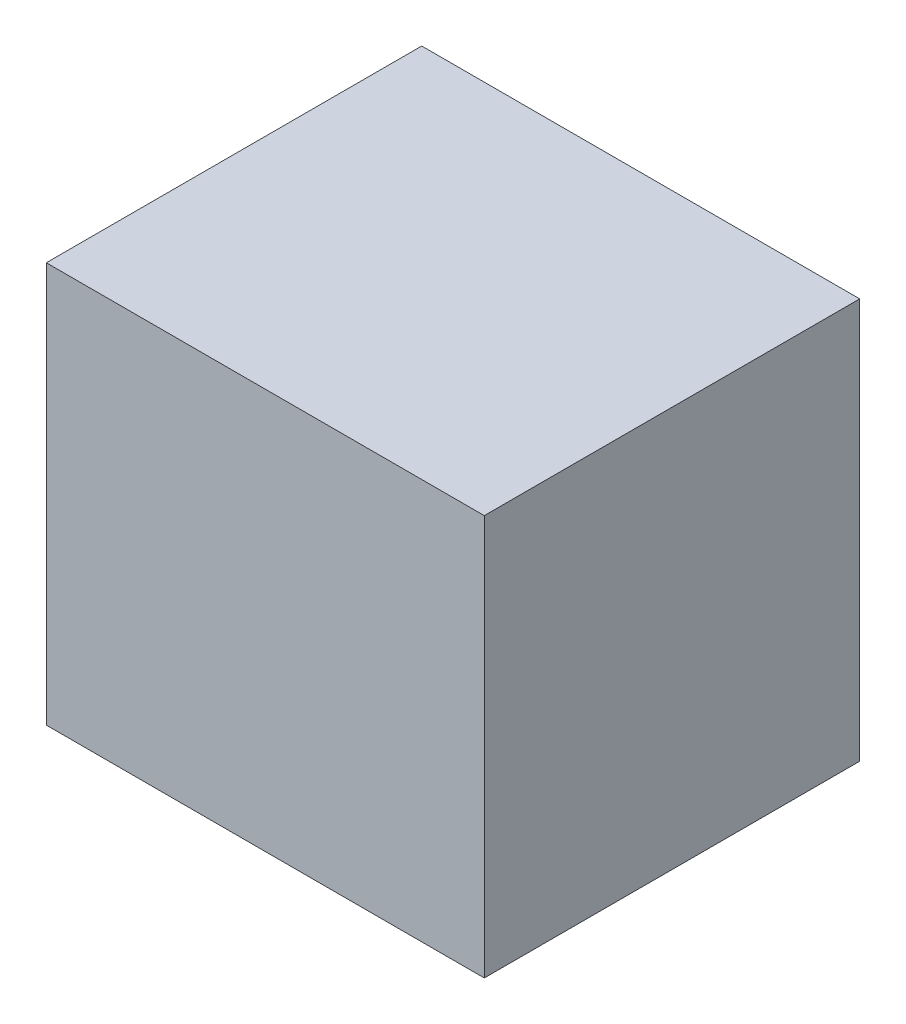
ISO-10303-21;
HEADER;
FILE_DESCRIPTION(('STEP AP214'),'2;1');
FILE_NAME('part.step','',(''),(''),'','','');
FILE_SCHEMA(('AUTOMOTIVE_DESIGN { 1 0 10303 214 1 1 1 1 }'));
ENDSEC;
DATA;
#1=APPLICATION_CONTEXT('core data for automotive mechanical design processes');
#2=APPLICATION_PROTOCOL_DEFINITION('international standard','automotive_design',2000,#1);
#3=PRODUCT_CONTEXT('',#1,'mechanical');
#4=PRODUCT('Part','Part','',(#3));
#5=PRODUCT_RELATED_PRODUCT_CATEGORY('part','',(#4));
#6=PRODUCT_DEFINITION_FORMATION('','',#4);
#7=PRODUCT_DEFINITION_CONTEXT('part definition',#1,'design');
#8=PRODUCT_DEFINITION('design','',#6,#7);
#9=PRODUCT_DEFINITION_SHAPE('','',#8);
#10=(LENGTH_UNIT() NAMED_UNIT(*) SI_UNIT(.MILLI.,.METRE.));
#11=(NAMED_UNIT(*) PLANE_ANGLE_UNIT() SI_UNIT($,.RADIAN.));
#12=(NAMED_UNIT(*) SI_UNIT($,.STERADIAN.) SOLID_ANGLE_UNIT());
#13=UNCERTAINTY_MEASURE_WITH_UNIT(LENGTH_MEASURE(1.E-05),#10,'distance_accuracy_value','');
#14=(GEOMETRIC_REPRESENTATION_CONTEXT(3) GLOBAL_UNCERTAINTY_ASSIGNED_CONTEXT((#13)) GLOBAL_UNIT_ASSIGNED_CONTEXT((#10,
#11,#12)) REPRESENTATION_CONTEXT('',''));
#15=CARTESIAN_POINT('',(0.,0.,0.));
#16=DIRECTION('',(0.,0.,1.));
#17=DIRECTION('',(1.,0.,0.));
#18=AXIS2_PLACEMENT_3D('',#15,#16,#17);
#19=CARTESIAN_POINT('',(0.52500022,-0.47999904,0.90000074));
#20=DIRECTION('',(0.,0.,-1.));
#21=DIRECTION('',(-1.,0.,0.));
#22=AXIS2_PLACEMENT_3D('',#19,#20,#21);
#23=PLANE('',#22);
#24=DIRECTION('',(1.,0.,0.));
#25=VECTOR('',#24,1.);
#26=CARTESIAN_POINT('',(0.52500022,0.48000158,0.90000074));
#27=LINE('',#26,#25);
#28=CARTESIAN_POINT('',(0.52500022,0.48000158,0.90000074));
#29=VERTEX_POINT('',#28);
#30=CARTESIAN_POINT('',(-0.52499768,0.48000158,0.90000074));
#31=VERTEX_POINT('',#30);
#32=EDGE_CURVE('E54',#29,#31,#27,.F.);
#33=ORIENTED_EDGE('',*,*,#32,.T.);
#34=DIRECTION('',(0.,1.,0.));
#35=VECTOR('',#34,1.);
#36=CARTESIAN_POINT('',(-0.52499768,0.48000158,0.90000074));
#37=LINE('',#36,#35);
#38=CARTESIAN_POINT('',(-0.52499768,-0.47999904,0.90000074));
#39=VERTEX_POINT('',#38);
#40=EDGE_CURVE('E56',#31,#39,#37,.F.);
#41=ORIENTED_EDGE('',*,*,#40,.T.);
#42=DIRECTION('',(1.,0.,0.));
#43=VECTOR('',#42,1.);
#44=CARTESIAN_POINT('',(-0.52499768,-0.47999904,0.90000074));
#45=LINE('',#44,#43);
#46=CARTESIAN_POINT('',(0.52500022,-0.47999904,0.90000074));
#47=VERTEX_POINT('',#46);
#48=EDGE_CURVE('E19',#39,#47,#45,.T.);
#49=ORIENTED_EDGE('',*,*,#48,.T.);
#50=DIRECTION('',(0.,1.,0.));
#51=VECTOR('',#50,1.);
#52=CARTESIAN_POINT('',(0.52500022,-0.47999904,0.90000074));
#53=LINE('',#52,#51);
#54=EDGE_CURVE('E79',#47,#29,#53,.T.);
#55=ORIENTED_EDGE('',*,*,#54,.T.);
#56=EDGE_LOOP('',(#33,#41,#49,#55));
#57=FACE_BOUND('',#56,.T.);
#58=ADVANCED_FACE('F16',(#57),#23,.F.);
#59=CARTESIAN_POINT('',(-0.52499768,-0.47999904,0.));
#60=DIRECTION('',(0.,1.,0.));
#61=DIRECTION('',(0.,0.,1.));
#62=AXIS2_PLACEMENT_3D('',#59,#60,#61);
#63=PLANE('',#62);
#64=DIRECTION('',(0.,0.,1.));
#65=VECTOR('',#64,1.);
#66=CARTESIAN_POINT('',(0.52500022,-0.47999904,0.));
#67=LINE('',#66,#65);
#68=CARTESIAN_POINT('',(0.52500022,-0.47999904,0.));
#69=VERTEX_POINT('',#68);
#70=EDGE_CURVE('E67',#69,#47,#67,.T.);
#71=ORIENTED_EDGE('',*,*,#70,.T.);
#72=ORIENTED_EDGE('',*,*,#48,.F.);
#73=DIRECTION('',(0.,0.,-1.));
#74=VECTOR('',#73,1.);
#75=CARTESIAN_POINT('',(-0.52499768,-0.47999904,0.));
#76=LINE('',#75,#74);
#77=CARTESIAN_POINT('',(-0.52499768,-0.47999904,0.));
#78=VERTEX_POINT('',#77);
#79=EDGE_CURVE('E62',#39,#78,#76,.T.);
#80=ORIENTED_EDGE('',*,*,#79,.T.);
#81=DIRECTION('',(-1.,0.,0.));
#82=VECTOR('',#81,1.);
#83=CARTESIAN_POINT('',(0.52500022,-0.47999904,0.));
#84=LINE('',#83,#82);
#85=EDGE_CURVE('E82',#69,#78,#84,.T.);
#86=ORIENTED_EDGE('',*,*,#85,.F.);
#87=EDGE_LOOP('',(#71,#72,#80,#86));
#88=FACE_BOUND('',#87,.T.);
#89=ADVANCED_FACE('F64',(#88),#63,.F.);
#90=CARTESIAN_POINT('',(-0.52499768,0.48000158,0.));
#91=DIRECTION('',(1.,0.,0.));
#92=DIRECTION('',(0.,0.,-1.));
#93=AXIS2_PLACEMENT_3D('',#90,#91,#92);
#94=PLANE('',#93);
#95=ORIENTED_EDGE('',*,*,#79,.F.);
#96=ORIENTED_EDGE('',*,*,#40,.F.);
#97=DIRECTION('',(0.,0.,-1.));
#98=VECTOR('',#97,1.);
#99=CARTESIAN_POINT('',(-0.52499768,0.48000158,0.));
#100=LINE('',#99,#98);
#101=CARTESIAN_POINT('',(-0.52499768,0.48000158,0.));
#102=VERTEX_POINT('',#101);
#103=EDGE_CURVE('E74',#31,#102,#100,.T.);
#104=ORIENTED_EDGE('',*,*,#103,.T.);
#105=DIRECTION('',(0.,1.,0.));
#106=VECTOR('',#105,1.);
#107=CARTESIAN_POINT('',(-0.52499768,-0.47999904,0.));
#108=LINE('',#107,#106);
#109=EDGE_CURVE('E71',#78,#102,#108,.T.);
#110=ORIENTED_EDGE('',*,*,#109,.F.);
#111=EDGE_LOOP('',(#95,#96,#104,#110));
#112=FACE_BOUND('',#111,.T.);
#113=ADVANCED_FACE('F69',(#112),#94,.F.);
#114=CARTESIAN_POINT('',(0.52500022,0.48000158,0.));
#115=DIRECTION('',(0.,-1.,0.));
#116=DIRECTION('',(0.,0.,-1.));
#117=AXIS2_PLACEMENT_3D('',#114,#115,#116);
#118=PLANE('',#117);
#119=ORIENTED_EDGE('',*,*,#103,.F.);
#120=ORIENTED_EDGE('',*,*,#32,.F.);
#121=DIRECTION('',(0.,0.,1.));
#122=VECTOR('',#121,1.);
#123=CARTESIAN_POINT('',(0.52500022,0.48000158,0.));
#124=LINE('',#123,#122);
#125=CARTESIAN_POINT('',(0.52500022,0.48000158,0.));
#126=VERTEX_POINT('',#125);
#127=EDGE_CURVE('E34',#29,#126,#124,.F.);
#128=ORIENTED_EDGE('',*,*,#127,.T.);
#129=DIRECTION('',(-1.,0.,0.));
#130=VECTOR('',#129,1.);
#131=CARTESIAN_POINT('',(0.52500022,0.48000158,0.));
#132=LINE('',#131,#130);
#133=EDGE_CURVE('E25',#102,#126,#132,.F.);
#134=ORIENTED_EDGE('',*,*,#133,.F.);
#135=EDGE_LOOP('',(#119,#120,#128,#134));
#136=FACE_BOUND('',#135,.T.);
#137=ADVANCED_FACE('F88',(#136),#118,.F.);
#138=CARTESIAN_POINT('',(0.52500022,-0.47999904,0.));
#139=DIRECTION('',(-1.,0.,0.));
#140=DIRECTION('',(0.,0.,1.));
#141=AXIS2_PLACEMENT_3D('',#138,#139,#140);
#142=PLANE('',#141);
#143=ORIENTED_EDGE('',*,*,#127,.F.);
#144=ORIENTED_EDGE('',*,*,#54,.F.);
#145=ORIENTED_EDGE('',*,*,#70,.F.);
#146=DIRECTION('',(0.,1.,0.));
#147=VECTOR('',#146,1.);
#148=CARTESIAN_POINT('',(0.52500022,-0.47999904,0.));
#149=LINE('',#148,#147);
#150=EDGE_CURVE('E11',#126,#69,#149,.F.);
#151=ORIENTED_EDGE('',*,*,#150,.F.);
#152=EDGE_LOOP('',(#143,#144,#145,#151));
#153=FACE_BOUND('',#152,.T.);
#154=ADVANCED_FACE('F90',(#153),#142,.F.);
#155=CARTESIAN_POINT('',(0.52500022,-0.47999904,0.));
#156=DIRECTION('',(0.,0.,-1.));
#157=DIRECTION('',(-1.,0.,0.));
#158=AXIS2_PLACEMENT_3D('',#155,#156,#157);
#159=PLANE('',#158);
#160=ORIENTED_EDGE('',*,*,#133,.T.);
#161=ORIENTED_EDGE('',*,*,#150,.T.);
#162=ORIENTED_EDGE('',*,*,#85,.T.);
#163=ORIENTED_EDGE('',*,*,#109,.T.);
#164=EDGE_LOOP('',(#160,#161,#162,#163));
#165=FACE_BOUND('',#164,.T.);
#166=ADVANCED_FACE('F87',(#165),#159,.T.);
#167=CLOSED_SHELL('',(#58,#89,#113,#137,#154,#166));
#168=MANIFOLD_SOLID_BREP('B1',#167);
#169=ADVANCED_BREP_SHAPE_REPRESENTATION('',(#18,#168),#14);
#170=SHAPE_DEFINITION_REPRESENTATION(#9,#169);
ENDSEC;
END-ISO-10303-21;
